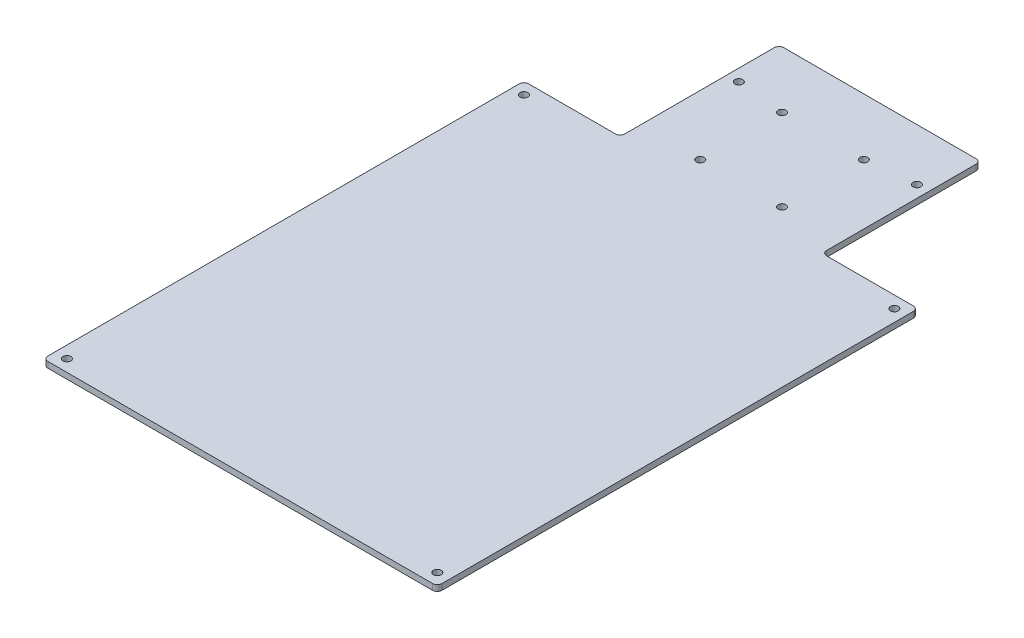
ISO-10303-21;
HEADER;
FILE_DESCRIPTION(('STEP AP214'),'2;1');
FILE_NAME('part.step','',(''),(''),'','','');
FILE_SCHEMA(('AUTOMOTIVE_DESIGN { 1 0 10303 214 1 1 1 1 }'));
ENDSEC;
DATA;
#1=APPLICATION_CONTEXT('core data for automotive mechanical design processes');
#2=APPLICATION_PROTOCOL_DEFINITION('international standard','automotive_design',2000,#1);
#3=PRODUCT_CONTEXT('',#1,'mechanical');
#4=PRODUCT('Part','Part','',(#3));
#5=PRODUCT_RELATED_PRODUCT_CATEGORY('part','',(#4));
#6=PRODUCT_DEFINITION_FORMATION('','',#4);
#7=PRODUCT_DEFINITION_CONTEXT('part definition',#1,'design');
#8=PRODUCT_DEFINITION('design','',#6,#7);
#9=PRODUCT_DEFINITION_SHAPE('','',#8);
#10=(LENGTH_UNIT() NAMED_UNIT(*) SI_UNIT(.MILLI.,.METRE.));
#11=(NAMED_UNIT(*) PLANE_ANGLE_UNIT() SI_UNIT($,.RADIAN.));
#12=(NAMED_UNIT(*) SI_UNIT($,.STERADIAN.) SOLID_ANGLE_UNIT());
#13=UNCERTAINTY_MEASURE_WITH_UNIT(LENGTH_MEASURE(1.E-05),#10,'distance_accuracy_value','');
#14=(GEOMETRIC_REPRESENTATION_CONTEXT(3) GLOBAL_UNCERTAINTY_ASSIGNED_CONTEXT((#13)) GLOBAL_UNIT_ASSIGNED_CONTEXT((#10,
#11,#12)) REPRESENTATION_CONTEXT('',''));
#15=CARTESIAN_POINT('',(0.,0.,0.));
#16=DIRECTION('',(0.,0.,1.));
#17=DIRECTION('',(1.,0.,0.));
#18=AXIS2_PLACEMENT_3D('',#15,#16,#17);
#19=CARTESIAN_POINT('',(0.,3.175,-244.475));
#20=DIRECTION('',(0.,0.,-1.));
#21=DIRECTION('',(-1.,0.,0.));
#22=AXIS2_PLACEMENT_3D('',#19,#20,#21);
#23=PLANE('',#22);
#24=DIRECTION('',(1.,0.,0.));
#25=VECTOR('',#24,1.);
#26=CARTESIAN_POINT('',(0.,0.,-244.475));
#27=LINE('',#26,#25);
#28=CARTESIAN_POINT('',(149.225,0.,-244.475));
#29=VERTEX_POINT('',#28);
#30=CARTESIAN_POINT('',(195.58,0.,-244.475));
#31=VERTEX_POINT('',#30);
#32=EDGE_CURVE('E249',#29,#31,#27,.T.);
#33=ORIENTED_EDGE('',*,*,#32,.F.);
#34=DIRECTION('',(0.,1.,0.));
#35=VECTOR('',#34,1.);
#36=CARTESIAN_POINT('',(149.225,3.175,-244.475));
#37=LINE('',#36,#35);
#38=CARTESIAN_POINT('',(149.225,3.175,-244.475));
#39=VERTEX_POINT('',#38);
#40=EDGE_CURVE('E286',#29,#39,#37,.T.);
#41=ORIENTED_EDGE('',*,*,#40,.T.);
#42=DIRECTION('',(1.,0.,0.));
#43=VECTOR('',#42,1.);
#44=CARTESIAN_POINT('',(0.,3.175,-244.475));
#45=LINE('',#44,#43);
#46=CARTESIAN_POINT('',(195.58,3.175,-244.475));
#47=VERTEX_POINT('',#46);
#48=EDGE_CURVE('E238',#39,#47,#45,.T.);
#49=ORIENTED_EDGE('',*,*,#48,.T.);
#50=DIRECTION('',(0.,-1.,0.));
#51=VECTOR('',#50,1.);
#52=CARTESIAN_POINT('',(195.58,0.,-244.475));
#53=LINE('',#52,#51);
#54=EDGE_CURVE('E283',#47,#31,#53,.T.);
#55=ORIENTED_EDGE('',*,*,#54,.T.);
#56=EDGE_LOOP('',(#33,#41,#49,#55));
#57=FACE_BOUND('',#56,.T.);
#58=ADVANCED_FACE('F49',(#57),#23,.T.);
#59=CARTESIAN_POINT('',(-12.7,3.175,0.));
#60=DIRECTION('',(-1.,0.,0.));
#61=DIRECTION('',(0.,0.,1.));
#62=AXIS2_PLACEMENT_3D('',#59,#60,#61);
#63=PLANE('',#62);
#64=DIRECTION('',(0.,0.,-1.));
#65=VECTOR('',#64,1.);
#66=CARTESIAN_POINT('',(-12.7,0.,0.));
#67=LINE('',#66,#65);
#68=CARTESIAN_POINT('',(-12.7,0.,10.16));
#69=VERTEX_POINT('',#68);
#70=CARTESIAN_POINT('',(-12.7,0.,-241.935));
#71=VERTEX_POINT('',#70);
#72=EDGE_CURVE('E225',#69,#71,#67,.T.);
#73=ORIENTED_EDGE('',*,*,#72,.F.);
#74=DIRECTION('',(0.,-1.,0.));
#75=VECTOR('',#74,1.);
#76=CARTESIAN_POINT('',(-12.7,3.175,10.16));
#77=LINE('',#76,#75);
#78=CARTESIAN_POINT('',(-12.7,3.175,10.16));
#79=VERTEX_POINT('',#78);
#80=EDGE_CURVE('E296',#69,#79,#77,.F.);
#81=ORIENTED_EDGE('',*,*,#80,.T.);
#82=DIRECTION('',(0.,0.,-1.));
#83=VECTOR('',#82,1.);
#84=CARTESIAN_POINT('',(-12.7,3.175,0.));
#85=LINE('',#84,#83);
#86=CARTESIAN_POINT('',(-12.7,3.175,-241.935));
#87=VERTEX_POINT('',#86);
#88=EDGE_CURVE('E228',#79,#87,#85,.T.);
#89=ORIENTED_EDGE('',*,*,#88,.T.);
#90=DIRECTION('',(0.,-1.,0.));
#91=VECTOR('',#90,1.);
#92=CARTESIAN_POINT('',(-12.7,3.175,-241.935));
#93=LINE('',#92,#91);
#94=EDGE_CURVE('E293',#87,#71,#93,.T.);
#95=ORIENTED_EDGE('',*,*,#94,.T.);
#96=EDGE_LOOP('',(#73,#81,#89,#95));
#97=FACE_BOUND('',#96,.T.);
#98=ADVANCED_FACE('F345',(#97),#63,.T.);
#99=CARTESIAN_POINT('',(0.,3.175,12.7));
#100=DIRECTION('',(0.,0.,-1.));
#101=DIRECTION('',(-1.,0.,0.));
#102=AXIS2_PLACEMENT_3D('',#99,#100,#101);
#103=PLANE('',#102);
#104=DIRECTION('',(1.,0.,0.));
#105=VECTOR('',#104,1.);
#106=CARTESIAN_POINT('',(0.,3.175,12.7));
#107=LINE('',#106,#105);
#108=CARTESIAN_POINT('',(-10.16,3.175,12.7));
#109=VERTEX_POINT('',#108);
#110=CARTESIAN_POINT('',(195.58,3.175,12.7));
#111=VERTEX_POINT('',#110);
#112=EDGE_CURVE('E231',#109,#111,#107,.T.);
#113=ORIENTED_EDGE('',*,*,#112,.F.);
#114=DIRECTION('',(0.,-1.,0.));
#115=VECTOR('',#114,1.);
#116=CARTESIAN_POINT('',(-10.16,0.,12.7));
#117=LINE('',#116,#115);
#118=CARTESIAN_POINT('',(-10.16,0.,12.7));
#119=VERTEX_POINT('',#118);
#120=EDGE_CURVE('E291',#109,#119,#117,.T.);
#121=ORIENTED_EDGE('',*,*,#120,.T.);
#122=DIRECTION('',(1.,0.,0.));
#123=VECTOR('',#122,1.);
#124=CARTESIAN_POINT('',(0.,0.,12.7));
#125=LINE('',#124,#123);
#126=CARTESIAN_POINT('',(195.58,0.,12.7));
#127=VERTEX_POINT('',#126);
#128=EDGE_CURVE('E244',#119,#127,#125,.T.);
#129=ORIENTED_EDGE('',*,*,#128,.T.);
#130=DIRECTION('',(0.,-1.,0.));
#131=VECTOR('',#130,1.);
#132=CARTESIAN_POINT('',(195.58,3.175,12.7));
#133=LINE('',#132,#131);
#134=EDGE_CURVE('E289',#127,#111,#133,.F.);
#135=ORIENTED_EDGE('',*,*,#134,.T.);
#136=EDGE_LOOP('',(#113,#121,#129,#135));
#137=FACE_BOUND('',#136,.T.);
#138=ADVANCED_FACE('F339',(#137),#103,.F.);
#139=CARTESIAN_POINT('',(198.12,3.175,0.));
#140=DIRECTION('',(-1.,0.,0.));
#141=DIRECTION('',(0.,0.,1.));
#142=AXIS2_PLACEMENT_3D('',#139,#140,#141);
#143=PLANE('',#142);
#144=DIRECTION('',(0.,0.,-1.));
#145=VECTOR('',#144,1.);
#146=CARTESIAN_POINT('',(198.12,0.,0.));
#147=LINE('',#146,#145);
#148=CARTESIAN_POINT('',(198.12,0.,10.16));
#149=VERTEX_POINT('',#148);
#150=CARTESIAN_POINT('',(198.12,0.,-241.935));
#151=VERTEX_POINT('',#150);
#152=EDGE_CURVE('E246',#149,#151,#147,.T.);
#153=ORIENTED_EDGE('',*,*,#152,.T.);
#154=DIRECTION('',(0.,-1.,0.));
#155=VECTOR('',#154,1.);
#156=CARTESIAN_POINT('',(198.12,3.175,-241.935));
#157=LINE('',#156,#155);
#158=CARTESIAN_POINT('',(198.12,3.175,-241.935));
#159=VERTEX_POINT('',#158);
#160=EDGE_CURVE('E301',#151,#159,#157,.F.);
#161=ORIENTED_EDGE('',*,*,#160,.T.);
#162=DIRECTION('',(0.,0.,-1.));
#163=VECTOR('',#162,1.);
#164=CARTESIAN_POINT('',(198.12,3.175,0.));
#165=LINE('',#164,#163);
#166=CARTESIAN_POINT('',(198.12,3.175,10.16));
#167=VERTEX_POINT('',#166);
#168=EDGE_CURVE('E235',#167,#159,#165,.T.);
#169=ORIENTED_EDGE('',*,*,#168,.F.);
#170=DIRECTION('',(0.,-1.,0.));
#171=VECTOR('',#170,1.);
#172=CARTESIAN_POINT('',(198.12,3.175,10.16));
#173=LINE('',#172,#171);
#174=EDGE_CURVE('E298',#167,#149,#173,.T.);
#175=ORIENTED_EDGE('',*,*,#174,.T.);
#176=EDGE_LOOP('',(#153,#161,#169,#175));
#177=FACE_BOUND('',#176,.T.);
#178=ADVANCED_FACE('F331',(#177),#143,.F.);
#179=CARTESIAN_POINT('',(-10.16,3.175,-244.475));
#180=VERTEX_POINT('',#179);
#181=CARTESIAN_POINT('',(36.195,3.175,-244.475));
#182=VERTEX_POINT('',#181);
#183=EDGE_CURVE('E239',#180,#182,#45,.T.);
#184=ORIENTED_EDGE('',*,*,#183,.T.);
#185=DIRECTION('',(0.,1.,0.));
#186=VECTOR('',#185,1.);
#187=CARTESIAN_POINT('',(36.195,3.175,-244.475));
#188=LINE('',#187,#186);
#189=CARTESIAN_POINT('',(36.195,0.,-244.475));
#190=VERTEX_POINT('',#189);
#191=EDGE_CURVE('E281',#182,#190,#188,.F.);
#192=ORIENTED_EDGE('',*,*,#191,.T.);
#193=CARTESIAN_POINT('',(-10.16,0.,-244.475));
#194=VERTEX_POINT('',#193);
#195=EDGE_CURVE('E232',#194,#190,#27,.T.);
#196=ORIENTED_EDGE('',*,*,#195,.F.);
#197=DIRECTION('',(0.,-1.,0.));
#198=VECTOR('',#197,1.);
#199=CARTESIAN_POINT('',(-10.16,3.175,-244.475));
#200=LINE('',#199,#198);
#201=EDGE_CURVE('E279',#194,#180,#200,.F.);
#202=ORIENTED_EDGE('',*,*,#201,.T.);
#203=EDGE_LOOP('',(#184,#192,#196,#202));
#204=FACE_BOUND('',#203,.T.);
#205=ADVANCED_FACE('F355',(#204),#23,.T.);
#206=CARTESIAN_POINT('',(0.,3.175,0.));
#207=DIRECTION('',(0.,1.,0.));
#208=DIRECTION('',(0.,0.,1.));
#209=AXIS2_PLACEMENT_3D('',#206,#207,#208);
#210=PLANE('',#209);
#211=CARTESIAN_POINT('',(70.8340960890755,3.175,-255.229096089076));
#212=DIRECTION('',(0.,1.,0.));
#213=DIRECTION('',(0.,0.,1.));
#214=AXIS2_PLACEMENT_3D('',#211,#212,#213);
#215=CIRCLE('',#214,2.0955);
#216=CARTESIAN_POINT('',(70.8340960890755,3.175,-253.133596089076));
#217=VERTEX_POINT('',#216);
#218=EDGE_CURVE('E684',#217,#217,#215,.T.);
#219=ORIENTED_EDGE('',*,*,#218,.F.);
#220=EDGE_LOOP('',(#219));
#221=FACE_BOUND('',#220,.T.);
#222=CARTESIAN_POINT('',(114.585903910924,3.175,-255.229096089076));
#223=DIRECTION('',(0.,1.,0.));
#224=DIRECTION('',(0.,0.,1.));
#225=AXIS2_PLACEMENT_3D('',#222,#223,#224);
#226=CIRCLE('',#225,2.0955);
#227=CARTESIAN_POINT('',(114.585903910924,3.175,-253.133596089076));
#228=VERTEX_POINT('',#227);
#229=EDGE_CURVE('E687',#228,#228,#226,.T.);
#230=ORIENTED_EDGE('',*,*,#229,.F.);
#231=EDGE_LOOP('',(#230));
#232=FACE_BOUND('',#231,.T.);
#233=CARTESIAN_POINT('',(114.585903910924,3.175,-298.980903910924));
#234=DIRECTION('',(0.,1.,0.));
#235=DIRECTION('',(0.,0.,1.));
#236=AXIS2_PLACEMENT_3D('',#233,#234,#235);
#237=CIRCLE('',#236,2.0955);
#238=CARTESIAN_POINT('',(114.585903910924,3.175,-296.885403910924));
#239=VERTEX_POINT('',#238);
#240=EDGE_CURVE('E380',#239,#239,#237,.T.);
#241=ORIENTED_EDGE('',*,*,#240,.F.);
#242=EDGE_LOOP('',(#241));
#243=FACE_BOUND('',#242,.T.);
#244=CARTESIAN_POINT('',(70.8340960890755,3.175,-298.980903910924));
#245=DIRECTION('',(0.,1.,0.));
#246=DIRECTION('',(0.,0.,1.));
#247=AXIS2_PLACEMENT_3D('',#244,#245,#246);
#248=CIRCLE('',#247,2.0955);
#249=CARTESIAN_POINT('',(70.8340960890755,3.175,-296.885403910924));
#250=VERTEX_POINT('',#249);
#251=EDGE_CURVE('E375',#250,#250,#248,.T.);
#252=ORIENTED_EDGE('',*,*,#251,.F.);
#253=EDGE_LOOP('',(#252));
#254=FACE_BOUND('',#253,.T.);
#255=CARTESIAN_POINT('',(-6.35,3.175,-238.125));
#256=DIRECTION('',(0.,1.,0.));
#257=DIRECTION('',(0.,0.,1.));
#258=AXIS2_PLACEMENT_3D('',#255,#256,#257);
#259=CIRCLE('',#258,2.09549999999999);
#260=CARTESIAN_POINT('',(-6.35,3.175,-236.0295));
#261=VERTEX_POINT('',#260);
#262=EDGE_CURVE('E218',#261,#261,#259,.T.);
#263=ORIENTED_EDGE('',*,*,#262,.F.);
#264=EDGE_LOOP('',(#263));
#265=FACE_BOUND('',#264,.T.);
#266=CARTESIAN_POINT('',(-6.35,3.175,6.35));
#267=DIRECTION('',(0.,1.,0.));
#268=DIRECTION('',(0.,0.,1.));
#269=AXIS2_PLACEMENT_3D('',#266,#267,#268);
#270=CIRCLE('',#269,2.0955);
#271=CARTESIAN_POINT('',(-6.35,3.175,8.4455));
#272=VERTEX_POINT('',#271);
#273=EDGE_CURVE('E212',#272,#272,#270,.T.);
#274=ORIENTED_EDGE('',*,*,#273,.F.);
#275=EDGE_LOOP('',(#274));
#276=FACE_BOUND('',#275,.T.);
#277=CARTESIAN_POINT('',(191.77,3.175,6.35));
#278=DIRECTION('',(0.,1.,0.));
#279=DIRECTION('',(0.,0.,1.));
#280=AXIS2_PLACEMENT_3D('',#277,#278,#279);
#281=CIRCLE('',#280,2.09549999999999);
#282=CARTESIAN_POINT('',(191.77,3.175,8.44549999999999));
#283=VERTEX_POINT('',#282);
#284=EDGE_CURVE('E206',#283,#283,#281,.T.);
#285=ORIENTED_EDGE('',*,*,#284,.F.);
#286=EDGE_LOOP('',(#285));
#287=FACE_BOUND('',#286,.T.);
#288=CARTESIAN_POINT('',(191.77,3.175,-238.125));
#289=DIRECTION('',(0.,1.,0.));
#290=DIRECTION('',(0.,0.,1.));
#291=AXIS2_PLACEMENT_3D('',#288,#289,#290);
#292=CIRCLE('',#291,2.09549999999998);
#293=CARTESIAN_POINT('',(191.77,3.175,-236.0295));
#294=VERTEX_POINT('',#293);
#295=EDGE_CURVE('E205',#294,#294,#292,.T.);
#296=ORIENTED_EDGE('',*,*,#295,.F.);
#297=EDGE_LOOP('',(#296));
#298=FACE_BOUND('',#297,.T.);
#299=DIRECTION('',(1.,0.,0.));
#300=VECTOR('',#299,1.);
#301=CARTESIAN_POINT('',(-1.69420033557799E-13,3.175,-329.4634));
#302=LINE('',#301,#300);
#303=CARTESIAN_POINT('',(41.275,3.175,-329.4634));
#304=VERTEX_POINT('',#303);
#305=CARTESIAN_POINT('',(144.145,3.175,-329.4634));
#306=VERTEX_POINT('',#305);
#307=EDGE_CURVE('E180',#304,#306,#302,.T.);
#308=ORIENTED_EDGE('',*,*,#307,.F.);
#309=CARTESIAN_POINT('',(41.275,3.175,-326.9234));
#310=DIRECTION('',(0.,1.,0.));
#311=DIRECTION('',(0.,0.,1.));
#312=AXIS2_PLACEMENT_3D('',#309,#310,#311);
#313=CIRCLE('',#312,2.54);
#314=CARTESIAN_POINT('',(38.735,3.175,-326.9234));
#315=VERTEX_POINT('',#314);
#316=EDGE_CURVE('E163',#304,#315,#313,.T.);
#317=ORIENTED_EDGE('',*,*,#316,.T.);
#318=DIRECTION('',(0.,0.,-1.));
#319=VECTOR('',#318,1.);
#320=CARTESIAN_POINT('',(38.735,3.175,0.));
#321=LINE('',#320,#319);
#322=CARTESIAN_POINT('',(38.735,3.175,-247.015));
#323=VERTEX_POINT('',#322);
#324=EDGE_CURVE('E190',#323,#315,#321,.T.);
#325=ORIENTED_EDGE('',*,*,#324,.F.);
#326=CARTESIAN_POINT('',(36.195,3.175,-247.015));
#327=DIRECTION('',(0.,1.,0.));
#328=DIRECTION('',(0.,0.,1.));
#329=AXIS2_PLACEMENT_3D('',#326,#327,#328);
#330=CIRCLE('',#329,2.54);
#331=EDGE_CURVE('E303',#323,#182,#330,.F.);
#332=ORIENTED_EDGE('',*,*,#331,.T.);
#333=ORIENTED_EDGE('',*,*,#183,.F.);
#334=CARTESIAN_POINT('',(-10.16,3.175,-241.935));
#335=DIRECTION('',(0.,1.,0.));
#336=DIRECTION('',(0.,0.,1.));
#337=AXIS2_PLACEMENT_3D('',#334,#335,#336);
#338=CIRCLE('',#337,2.54);
#339=EDGE_CURVE('E256',#180,#87,#338,.T.);
#340=ORIENTED_EDGE('',*,*,#339,.T.);
#341=ORIENTED_EDGE('',*,*,#88,.F.);
#342=CARTESIAN_POINT('',(-10.16,3.175,10.16));
#343=DIRECTION('',(0.,1.,0.));
#344=DIRECTION('',(0.,0.,1.));
#345=AXIS2_PLACEMENT_3D('',#342,#343,#344);
#346=CIRCLE('',#345,2.54);
#347=EDGE_CURVE('E258',#79,#109,#346,.T.);
#348=ORIENTED_EDGE('',*,*,#347,.T.);
#349=ORIENTED_EDGE('',*,*,#112,.T.);
#350=CARTESIAN_POINT('',(195.58,3.175,10.16));
#351=DIRECTION('',(0.,1.,0.));
#352=DIRECTION('',(0.,0.,1.));
#353=AXIS2_PLACEMENT_3D('',#350,#351,#352);
#354=CIRCLE('',#353,2.54);
#355=EDGE_CURVE('E184',#111,#167,#354,.T.);
#356=ORIENTED_EDGE('',*,*,#355,.T.);
#357=ORIENTED_EDGE('',*,*,#168,.T.);
#358=CARTESIAN_POINT('',(195.58,3.175,-241.935));
#359=DIRECTION('',(0.,1.,0.));
#360=DIRECTION('',(0.,0.,1.));
#361=AXIS2_PLACEMENT_3D('',#358,#359,#360);
#362=CIRCLE('',#361,2.54);
#363=EDGE_CURVE('E254',#159,#47,#362,.T.);
#364=ORIENTED_EDGE('',*,*,#363,.T.);
#365=ORIENTED_EDGE('',*,*,#48,.F.);
#366=CARTESIAN_POINT('',(149.225,3.175,-247.015));
#367=DIRECTION('',(0.,1.,0.));
#368=DIRECTION('',(0.,0.,1.));
#369=AXIS2_PLACEMENT_3D('',#366,#367,#368);
#370=CIRCLE('',#369,2.54);
#371=CARTESIAN_POINT('',(146.685,3.175,-247.015));
#372=VERTEX_POINT('',#371);
#373=EDGE_CURVE('E57',#39,#372,#370,.F.);
#374=ORIENTED_EDGE('',*,*,#373,.T.);
#375=DIRECTION('',(0.,0.,-1.));
#376=VECTOR('',#375,1.);
#377=CARTESIAN_POINT('',(146.685000000001,3.175,-3.78932503972241E-13));
#378=LINE('',#377,#376);
#379=CARTESIAN_POINT('',(146.685,3.175,-326.9234));
#380=VERTEX_POINT('',#379);
#381=EDGE_CURVE('E191',#372,#380,#378,.T.);
#382=ORIENTED_EDGE('',*,*,#381,.T.);
#383=CARTESIAN_POINT('',(144.145,3.175,-326.9234));
#384=DIRECTION('',(0.,1.,0.));
#385=DIRECTION('',(0.,0.,1.));
#386=AXIS2_PLACEMENT_3D('',#383,#384,#385);
#387=CIRCLE('',#386,2.54);
#388=EDGE_CURVE('E174',#380,#306,#387,.T.);
#389=ORIENTED_EDGE('',*,*,#388,.T.);
#390=EDGE_LOOP('',(#308,#317,#325,#332,#333,#340,#341,#348,#349,#356,#357,#364,#365,#374,#382,#389));
#391=FACE_BOUND('',#390,.T.);
#392=CARTESIAN_POINT('',(140.335,3.175,-301.625));
#393=DIRECTION('',(0.,1.,0.));
#394=DIRECTION('',(0.,0.,1.));
#395=AXIS2_PLACEMENT_3D('',#392,#393,#394);
#396=CIRCLE('',#395,2.09549999999998);
#397=CARTESIAN_POINT('',(140.335,3.175,-299.5295));
#398=VERTEX_POINT('',#397);
#399=EDGE_CURVE('E195',#398,#398,#396,.T.);
#400=ORIENTED_EDGE('',*,*,#399,.F.);
#401=EDGE_LOOP('',(#400));
#402=FACE_BOUND('',#401,.T.);
#403=CARTESIAN_POINT('',(45.085,3.175,-301.625));
#404=DIRECTION('',(0.,1.,0.));
#405=DIRECTION('',(0.,0.,1.));
#406=AXIS2_PLACEMENT_3D('',#403,#404,#405);
#407=CIRCLE('',#406,2.0955);
#408=CARTESIAN_POINT('',(45.085,3.175,-299.5295));
#409=VERTEX_POINT('',#408);
#410=EDGE_CURVE('E193',#409,#409,#407,.T.);
#411=ORIENTED_EDGE('',*,*,#410,.F.);
#412=EDGE_LOOP('',(#411));
#413=FACE_BOUND('',#412,.T.);
#414=ADVANCED_FACE('F187',(#221,#232,#243,#254,#265,#276,#287,#298,#391,#402,#413),#210,.T.);
#415=CARTESIAN_POINT('',(0.,0.,0.));
#416=DIRECTION('',(0.,1.,0.));
#417=DIRECTION('',(0.,0.,1.));
#418=AXIS2_PLACEMENT_3D('',#415,#416,#417);
#419=PLANE('',#418);
#420=CARTESIAN_POINT('',(70.8340960890755,0.,-255.229096089076));
#421=DIRECTION('',(0.,1.,0.));
#422=DIRECTION('',(0.,0.,1.));
#423=AXIS2_PLACEMENT_3D('',#420,#421,#422);
#424=CIRCLE('',#423,2.0955);
#425=CARTESIAN_POINT('',(70.8340960890755,0.,-253.133596089076));
#426=VERTEX_POINT('',#425);
#427=EDGE_CURVE('E681',#426,#426,#424,.F.);
#428=ORIENTED_EDGE('',*,*,#427,.F.);
#429=EDGE_LOOP('',(#428));
#430=FACE_BOUND('',#429,.T.);
#431=CARTESIAN_POINT('',(114.585903910924,0.,-255.229096089076));
#432=DIRECTION('',(0.,1.,0.));
#433=DIRECTION('',(0.,0.,1.));
#434=AXIS2_PLACEMENT_3D('',#431,#432,#433);
#435=CIRCLE('',#434,2.0955);
#436=CARTESIAN_POINT('',(114.585903910924,0.,-253.133596089076));
#437=VERTEX_POINT('',#436);
#438=EDGE_CURVE('E685',#437,#437,#435,.F.);
#439=ORIENTED_EDGE('',*,*,#438,.F.);
#440=EDGE_LOOP('',(#439));
#441=FACE_BOUND('',#440,.T.);
#442=CARTESIAN_POINT('',(114.585903910924,0.,-298.980903910924));
#443=DIRECTION('',(0.,1.,0.));
#444=DIRECTION('',(0.,0.,1.));
#445=AXIS2_PLACEMENT_3D('',#442,#443,#444);
#446=CIRCLE('',#445,2.0955);
#447=CARTESIAN_POINT('',(114.585903910924,0.,-296.885403910924));
#448=VERTEX_POINT('',#447);
#449=EDGE_CURVE('E692',#448,#448,#446,.F.);
#450=ORIENTED_EDGE('',*,*,#449,.F.);
#451=EDGE_LOOP('',(#450));
#452=FACE_BOUND('',#451,.T.);
#453=CARTESIAN_POINT('',(70.8340960890755,0.,-298.980903910924));
#454=DIRECTION('',(0.,1.,0.));
#455=DIRECTION('',(0.,0.,1.));
#456=AXIS2_PLACEMENT_3D('',#453,#454,#455);
#457=CIRCLE('',#456,2.0955);
#458=CARTESIAN_POINT('',(70.8340960890755,0.,-296.885403910924));
#459=VERTEX_POINT('',#458);
#460=EDGE_CURVE('E371',#459,#459,#457,.F.);
#461=ORIENTED_EDGE('',*,*,#460,.F.);
#462=EDGE_LOOP('',(#461));
#463=FACE_BOUND('',#462,.T.);
#464=CARTESIAN_POINT('',(-6.35,0.,-238.125));
#465=DIRECTION('',(0.,1.,0.));
#466=DIRECTION('',(0.,0.,1.));
#467=AXIS2_PLACEMENT_3D('',#464,#465,#466);
#468=CIRCLE('',#467,2.09549999999999);
#469=CARTESIAN_POINT('',(-6.35,0.,-236.0295));
#470=VERTEX_POINT('',#469);
#471=EDGE_CURVE('E215',#470,#470,#468,.T.);
#472=ORIENTED_EDGE('',*,*,#471,.T.);
#473=EDGE_LOOP('',(#472));
#474=FACE_BOUND('',#473,.T.);
#475=CARTESIAN_POINT('',(-6.35,0.,6.35));
#476=DIRECTION('',(0.,1.,0.));
#477=DIRECTION('',(0.,0.,1.));
#478=AXIS2_PLACEMENT_3D('',#475,#476,#477);
#479=CIRCLE('',#478,2.0955);
#480=CARTESIAN_POINT('',(-6.35,0.,8.4455));
#481=VERTEX_POINT('',#480);
#482=EDGE_CURVE('E209',#481,#481,#479,.T.);
#483=ORIENTED_EDGE('',*,*,#482,.T.);
#484=EDGE_LOOP('',(#483));
#485=FACE_BOUND('',#484,.T.);
#486=CARTESIAN_POINT('',(191.77,0.,6.35));
#487=DIRECTION('',(0.,1.,0.));
#488=DIRECTION('',(0.,0.,1.));
#489=AXIS2_PLACEMENT_3D('',#486,#487,#488);
#490=CIRCLE('',#489,2.09549999999999);
#491=CARTESIAN_POINT('',(191.77,0.,8.44549999999999));
#492=VERTEX_POINT('',#491);
#493=EDGE_CURVE('E202',#492,#492,#490,.T.);
#494=ORIENTED_EDGE('',*,*,#493,.T.);
#495=EDGE_LOOP('',(#494));
#496=FACE_BOUND('',#495,.T.);
#497=CARTESIAN_POINT('',(191.77,0.,-238.125));
#498=DIRECTION('',(0.,1.,0.));
#499=DIRECTION('',(0.,0.,1.));
#500=AXIS2_PLACEMENT_3D('',#497,#498,#499);
#501=CIRCLE('',#500,2.09549999999998);
#502=CARTESIAN_POINT('',(191.77,0.,-236.0295));
#503=VERTEX_POINT('',#502);
#504=EDGE_CURVE('E222',#503,#503,#501,.T.);
#505=ORIENTED_EDGE('',*,*,#504,.T.);
#506=EDGE_LOOP('',(#505));
#507=FACE_BOUND('',#506,.T.);
#508=DIRECTION('',(0.,0.,-1.));
#509=VECTOR('',#508,1.);
#510=CARTESIAN_POINT('',(38.735,0.,0.));
#511=LINE('',#510,#509);
#512=CARTESIAN_POINT('',(38.735,0.,-247.015));
#513=VERTEX_POINT('',#512);
#514=CARTESIAN_POINT('',(38.735,0.,-326.9234));
#515=VERTEX_POINT('',#514);
#516=EDGE_CURVE('E362',#513,#515,#511,.T.);
#517=ORIENTED_EDGE('',*,*,#516,.T.);
#518=CARTESIAN_POINT('',(41.275,0.,-326.9234));
#519=DIRECTION('',(0.,1.,0.));
#520=DIRECTION('',(0.,0.,1.));
#521=AXIS2_PLACEMENT_3D('',#518,#519,#520);
#522=CIRCLE('',#521,2.54);
#523=CARTESIAN_POINT('',(41.275,0.,-329.4634));
#524=VERTEX_POINT('',#523);
#525=EDGE_CURVE('E272',#515,#524,#522,.F.);
#526=ORIENTED_EDGE('',*,*,#525,.T.);
#527=DIRECTION('',(1.,0.,0.));
#528=VECTOR('',#527,1.);
#529=CARTESIAN_POINT('',(-1.69420033557799E-13,0.,-329.4634));
#530=LINE('',#529,#528);
#531=CARTESIAN_POINT('',(144.145,0.,-329.4634));
#532=VERTEX_POINT('',#531);
#533=EDGE_CURVE('E183',#524,#532,#530,.T.);
#534=ORIENTED_EDGE('',*,*,#533,.T.);
#535=CARTESIAN_POINT('',(144.145,0.,-326.9234));
#536=DIRECTION('',(0.,1.,0.));
#537=DIRECTION('',(0.,0.,1.));
#538=AXIS2_PLACEMENT_3D('',#535,#536,#537);
#539=CIRCLE('',#538,2.54);
#540=CARTESIAN_POINT('',(146.685,0.,-326.9234));
#541=VERTEX_POINT('',#540);
#542=EDGE_CURVE('E270',#532,#541,#539,.F.);
#543=ORIENTED_EDGE('',*,*,#542,.T.);
#544=DIRECTION('',(0.,0.,-1.));
#545=VECTOR('',#544,1.);
#546=CARTESIAN_POINT('',(146.685000000001,0.,-3.78932503972241E-13));
#547=LINE('',#546,#545);
#548=CARTESIAN_POINT('',(146.685,0.,-247.015));
#549=VERTEX_POINT('',#548);
#550=EDGE_CURVE('E323',#549,#541,#547,.T.);
#551=ORIENTED_EDGE('',*,*,#550,.F.);
#552=CARTESIAN_POINT('',(149.225,0.,-247.015));
#553=DIRECTION('',(0.,1.,0.));
#554=DIRECTION('',(0.,0.,1.));
#555=AXIS2_PLACEMENT_3D('',#552,#553,#554);
#556=CIRCLE('',#555,2.54);
#557=EDGE_CURVE('E11',#549,#29,#556,.T.);
#558=ORIENTED_EDGE('',*,*,#557,.T.);
#559=ORIENTED_EDGE('',*,*,#32,.T.);
#560=CARTESIAN_POINT('',(195.58,0.,-241.935));
#561=DIRECTION('',(0.,1.,0.));
#562=DIRECTION('',(0.,0.,1.));
#563=AXIS2_PLACEMENT_3D('',#560,#561,#562);
#564=CIRCLE('',#563,2.54);
#565=EDGE_CURVE('E265',#31,#151,#564,.F.);
#566=ORIENTED_EDGE('',*,*,#565,.T.);
#567=ORIENTED_EDGE('',*,*,#152,.F.);
#568=CARTESIAN_POINT('',(195.58,0.,10.16));
#569=DIRECTION('',(0.,1.,0.));
#570=DIRECTION('',(0.,0.,1.));
#571=AXIS2_PLACEMENT_3D('',#568,#569,#570);
#572=CIRCLE('',#571,2.54);
#573=EDGE_CURVE('E64',#149,#127,#572,.F.);
#574=ORIENTED_EDGE('',*,*,#573,.T.);
#575=ORIENTED_EDGE('',*,*,#128,.F.);
#576=CARTESIAN_POINT('',(-10.16,0.,10.16));
#577=DIRECTION('',(0.,1.,0.));
#578=DIRECTION('',(0.,0.,1.));
#579=AXIS2_PLACEMENT_3D('',#576,#577,#578);
#580=CIRCLE('',#579,2.54);
#581=EDGE_CURVE('E72',#119,#69,#580,.F.);
#582=ORIENTED_EDGE('',*,*,#581,.T.);
#583=ORIENTED_EDGE('',*,*,#72,.T.);
#584=CARTESIAN_POINT('',(-10.16,0.,-241.935));
#585=DIRECTION('',(0.,1.,0.));
#586=DIRECTION('',(0.,0.,1.));
#587=AXIS2_PLACEMENT_3D('',#584,#585,#586);
#588=CIRCLE('',#587,2.54);
#589=EDGE_CURVE('E267',#71,#194,#588,.F.);
#590=ORIENTED_EDGE('',*,*,#589,.T.);
#591=ORIENTED_EDGE('',*,*,#195,.T.);
#592=CARTESIAN_POINT('',(36.195,0.,-247.015));
#593=DIRECTION('',(0.,1.,0.));
#594=DIRECTION('',(0.,0.,1.));
#595=AXIS2_PLACEMENT_3D('',#592,#593,#594);
#596=CIRCLE('',#595,2.54);
#597=EDGE_CURVE('E305',#190,#513,#596,.T.);
#598=ORIENTED_EDGE('',*,*,#597,.T.);
#599=EDGE_LOOP('',(#517,#526,#534,#543,#551,#558,#559,#566,#567,#574,#575,#582,#583,#590,#591,#598));
#600=FACE_BOUND('',#599,.T.);
#601=CARTESIAN_POINT('',(140.335,0.,-301.625));
#602=DIRECTION('',(0.,1.,0.));
#603=DIRECTION('',(0.,0.,1.));
#604=AXIS2_PLACEMENT_3D('',#601,#602,#603);
#605=CIRCLE('',#604,2.09549999999998);
#606=CARTESIAN_POINT('',(140.335,0.,-299.5295));
#607=VERTEX_POINT('',#606);
#608=EDGE_CURVE('E201',#607,#607,#605,.T.);
#609=ORIENTED_EDGE('',*,*,#608,.T.);
#610=EDGE_LOOP('',(#609));
#611=FACE_BOUND('',#610,.T.);
#612=CARTESIAN_POINT('',(45.085,0.,-301.625));
#613=DIRECTION('',(0.,1.,0.));
#614=DIRECTION('',(0.,0.,1.));
#615=AXIS2_PLACEMENT_3D('',#612,#613,#614);
#616=CIRCLE('',#615,2.0955);
#617=CARTESIAN_POINT('',(45.085,0.,-299.5295));
#618=VERTEX_POINT('',#617);
#619=EDGE_CURVE('E221',#618,#618,#616,.T.);
#620=ORIENTED_EDGE('',*,*,#619,.T.);
#621=EDGE_LOOP('',(#620));
#622=FACE_BOUND('',#621,.T.);
#623=ADVANCED_FACE('F321',(#430,#441,#452,#463,#474,#485,#496,#507,#600,#611,#622),#419,.F.);
#624=CARTESIAN_POINT('',(191.77,0.,-238.125));
#625=DIRECTION('',(0.,1.,0.));
#626=DIRECTION('',(0.,0.,1.));
#627=AXIS2_PLACEMENT_3D('',#624,#625,#626);
#628=CYLINDRICAL_SURFACE('',#627,2.09549999999998);
#629=ORIENTED_EDGE('',*,*,#504,.F.);
#630=EDGE_LOOP('',(#629));
#631=FACE_BOUND('',#630,.T.);
#632=ORIENTED_EDGE('',*,*,#295,.T.);
#633=EDGE_LOOP('',(#632));
#634=FACE_BOUND('',#633,.T.);
#635=ADVANCED_FACE('F449',(#631,#634),#628,.F.);
#636=CARTESIAN_POINT('',(191.77,0.,6.35));
#637=DIRECTION('',(0.,1.,0.));
#638=DIRECTION('',(0.,0.,1.));
#639=AXIS2_PLACEMENT_3D('',#636,#637,#638);
#640=CYLINDRICAL_SURFACE('',#639,2.09549999999999);
#641=ORIENTED_EDGE('',*,*,#493,.F.);
#642=EDGE_LOOP('',(#641));
#643=FACE_BOUND('',#642,.T.);
#644=ORIENTED_EDGE('',*,*,#284,.T.);
#645=EDGE_LOOP('',(#644));
#646=FACE_BOUND('',#645,.T.);
#647=ADVANCED_FACE('F458',(#643,#646),#640,.F.);
#648=CARTESIAN_POINT('',(-6.35,0.,6.35));
#649=DIRECTION('',(0.,1.,0.));
#650=DIRECTION('',(0.,0.,1.));
#651=AXIS2_PLACEMENT_3D('',#648,#649,#650);
#652=CYLINDRICAL_SURFACE('',#651,2.0955);
#653=ORIENTED_EDGE('',*,*,#482,.F.);
#654=EDGE_LOOP('',(#653));
#655=FACE_BOUND('',#654,.T.);
#656=ORIENTED_EDGE('',*,*,#273,.T.);
#657=EDGE_LOOP('',(#656));
#658=FACE_BOUND('',#657,.T.);
#659=ADVANCED_FACE('F467',(#655,#658),#652,.F.);
#660=CARTESIAN_POINT('',(-6.35,0.,-238.125));
#661=DIRECTION('',(0.,1.,0.));
#662=DIRECTION('',(0.,0.,1.));
#663=AXIS2_PLACEMENT_3D('',#660,#661,#662);
#664=CYLINDRICAL_SURFACE('',#663,2.09549999999999);
#665=ORIENTED_EDGE('',*,*,#471,.F.);
#666=EDGE_LOOP('',(#665));
#667=FACE_BOUND('',#666,.T.);
#668=ORIENTED_EDGE('',*,*,#262,.T.);
#669=EDGE_LOOP('',(#668));
#670=FACE_BOUND('',#669,.T.);
#671=ADVANCED_FACE('F476',(#667,#670),#664,.F.);
#672=CARTESIAN_POINT('',(38.735,0.,0.));
#673=DIRECTION('',(1.,0.,0.));
#674=DIRECTION('',(0.,0.,-1.));
#675=AXIS2_PLACEMENT_3D('',#672,#673,#674);
#676=PLANE('',#675);
#677=ORIENTED_EDGE('',*,*,#324,.T.);
#678=DIRECTION('',(0.,1.,0.));
#679=VECTOR('',#678,1.);
#680=CARTESIAN_POINT('',(38.735,0.,-326.9234));
#681=LINE('',#680,#679);
#682=EDGE_CURVE('E168',#315,#515,#681,.F.);
#683=ORIENTED_EDGE('',*,*,#682,.T.);
#684=ORIENTED_EDGE('',*,*,#516,.F.);
#685=DIRECTION('',(0.,1.,0.));
#686=VECTOR('',#685,1.);
#687=CARTESIAN_POINT('',(38.735,0.,-247.015));
#688=LINE('',#687,#686);
#689=EDGE_CURVE('E173',#513,#323,#688,.T.);
#690=ORIENTED_EDGE('',*,*,#689,.T.);
#691=EDGE_LOOP('',(#677,#683,#684,#690));
#692=FACE_BOUND('',#691,.T.);
#693=ADVANCED_FACE('F364',(#692),#676,.F.);
#694=CARTESIAN_POINT('',(-1.69420033557799E-13,0.,-329.4634));
#695=DIRECTION('',(0.,0.,1.));
#696=DIRECTION('',(1.,0.,0.));
#697=AXIS2_PLACEMENT_3D('',#694,#695,#696);
#698=PLANE('',#697);
#699=ORIENTED_EDGE('',*,*,#533,.F.);
#700=DIRECTION('',(0.,1.,0.));
#701=VECTOR('',#700,1.);
#702=CARTESIAN_POINT('',(41.275,0.,-329.4634));
#703=LINE('',#702,#701);
#704=EDGE_CURVE('E167',#524,#304,#703,.T.);
#705=ORIENTED_EDGE('',*,*,#704,.T.);
#706=ORIENTED_EDGE('',*,*,#307,.T.);
#707=DIRECTION('',(0.,1.,0.));
#708=VECTOR('',#707,1.);
#709=CARTESIAN_POINT('',(144.145,0.,-329.4634));
#710=LINE('',#709,#708);
#711=EDGE_CURVE('E185',#306,#532,#710,.F.);
#712=ORIENTED_EDGE('',*,*,#711,.T.);
#713=EDGE_LOOP('',(#699,#705,#706,#712));
#714=FACE_BOUND('',#713,.T.);
#715=ADVANCED_FACE('F179',(#714),#698,.F.);
#716=CARTESIAN_POINT('',(146.685000000001,0.,-3.78932503972241E-13));
#717=DIRECTION('',(1.,0.,0.));
#718=DIRECTION('',(0.,0.,-1.));
#719=AXIS2_PLACEMENT_3D('',#716,#717,#718);
#720=PLANE('',#719);
#721=ORIENTED_EDGE('',*,*,#550,.T.);
#722=DIRECTION('',(0.,1.,0.));
#723=VECTOR('',#722,1.);
#724=CARTESIAN_POINT('',(146.685,3.175,-326.9234));
#725=LINE('',#724,#723);
#726=EDGE_CURVE('E276',#541,#380,#725,.T.);
#727=ORIENTED_EDGE('',*,*,#726,.T.);
#728=ORIENTED_EDGE('',*,*,#381,.F.);
#729=DIRECTION('',(0.,1.,0.));
#730=VECTOR('',#729,1.);
#731=CARTESIAN_POINT('',(146.685,0.,-247.015));
#732=LINE('',#731,#730);
#733=EDGE_CURVE('E274',#372,#549,#732,.F.);
#734=ORIENTED_EDGE('',*,*,#733,.T.);
#735=EDGE_LOOP('',(#721,#727,#728,#734));
#736=FACE_BOUND('',#735,.T.);
#737=ADVANCED_FACE('F314',(#736),#720,.T.);
#738=CARTESIAN_POINT('',(140.335,0.,-301.625));
#739=DIRECTION('',(0.,1.,0.));
#740=DIRECTION('',(0.,0.,1.));
#741=AXIS2_PLACEMENT_3D('',#738,#739,#740);
#742=CYLINDRICAL_SURFACE('',#741,2.09549999999998);
#743=ORIENTED_EDGE('',*,*,#608,.F.);
#744=EDGE_LOOP('',(#743));
#745=FACE_BOUND('',#744,.T.);
#746=ORIENTED_EDGE('',*,*,#399,.T.);
#747=EDGE_LOOP('',(#746));
#748=FACE_BOUND('',#747,.T.);
#749=ADVANCED_FACE('F513',(#745,#748),#742,.F.);
#750=CARTESIAN_POINT('',(45.085,0.,-301.625));
#751=DIRECTION('',(0.,1.,0.));
#752=DIRECTION('',(0.,0.,1.));
#753=AXIS2_PLACEMENT_3D('',#750,#751,#752);
#754=CYLINDRICAL_SURFACE('',#753,2.0955);
#755=ORIENTED_EDGE('',*,*,#619,.F.);
#756=EDGE_LOOP('',(#755));
#757=FACE_BOUND('',#756,.T.);
#758=ORIENTED_EDGE('',*,*,#410,.T.);
#759=EDGE_LOOP('',(#758));
#760=FACE_BOUND('',#759,.T.);
#761=ADVANCED_FACE('F395',(#757,#760),#754,.F.);
#762=CARTESIAN_POINT('',(41.275,0.,-326.9234));
#763=DIRECTION('',(0.,1.,0.));
#764=DIRECTION('',(0.,0.,1.));
#765=AXIS2_PLACEMENT_3D('',#762,#763,#764);
#766=CYLINDRICAL_SURFACE('',#765,2.54);
#767=ORIENTED_EDGE('',*,*,#525,.F.);
#768=ORIENTED_EDGE('',*,*,#682,.F.);
#769=ORIENTED_EDGE('',*,*,#316,.F.);
#770=ORIENTED_EDGE('',*,*,#704,.F.);
#771=EDGE_LOOP('',(#767,#768,#769,#770));
#772=FACE_BOUND('',#771,.T.);
#773=ADVANCED_FACE('F166',(#772),#766,.T.);
#774=CARTESIAN_POINT('',(144.145,0.,-326.9234));
#775=DIRECTION('',(0.,-1.,0.));
#776=DIRECTION('',(0.,0.,-1.));
#777=AXIS2_PLACEMENT_3D('',#774,#775,#776);
#778=CYLINDRICAL_SURFACE('',#777,2.54);
#779=ORIENTED_EDGE('',*,*,#542,.F.);
#780=ORIENTED_EDGE('',*,*,#711,.F.);
#781=ORIENTED_EDGE('',*,*,#388,.F.);
#782=ORIENTED_EDGE('',*,*,#726,.F.);
#783=EDGE_LOOP('',(#779,#780,#781,#782));
#784=FACE_BOUND('',#783,.T.);
#785=ADVANCED_FACE('F387',(#784),#778,.T.);
#786=CARTESIAN_POINT('',(36.195,0.,-247.015));
#787=DIRECTION('',(0.,1.,0.));
#788=DIRECTION('',(0.,0.,1.));
#789=AXIS2_PLACEMENT_3D('',#786,#787,#788);
#790=CYLINDRICAL_SURFACE('',#789,2.54);
#791=ORIENTED_EDGE('',*,*,#597,.F.);
#792=ORIENTED_EDGE('',*,*,#191,.F.);
#793=ORIENTED_EDGE('',*,*,#331,.F.);
#794=ORIENTED_EDGE('',*,*,#689,.F.);
#795=EDGE_LOOP('',(#791,#792,#793,#794));
#796=FACE_BOUND('',#795,.T.);
#797=ADVANCED_FACE('F359',(#796),#790,.F.);
#798=CARTESIAN_POINT('',(149.225,3.175,-247.015));
#799=DIRECTION('',(0.,-1.,0.));
#800=DIRECTION('',(0.,0.,-1.));
#801=AXIS2_PLACEMENT_3D('',#798,#799,#800);
#802=CYLINDRICAL_SURFACE('',#801,2.54);
#803=ORIENTED_EDGE('',*,*,#557,.F.);
#804=ORIENTED_EDGE('',*,*,#733,.F.);
#805=ORIENTED_EDGE('',*,*,#373,.F.);
#806=ORIENTED_EDGE('',*,*,#40,.F.);
#807=EDGE_LOOP('',(#803,#804,#805,#806));
#808=FACE_BOUND('',#807,.T.);
#809=ADVANCED_FACE('F318',(#808),#802,.F.);
#810=CARTESIAN_POINT('',(-10.16,3.175,10.16));
#811=DIRECTION('',(0.,1.,0.));
#812=DIRECTION('',(0.,0.,1.));
#813=AXIS2_PLACEMENT_3D('',#810,#811,#812);
#814=CYLINDRICAL_SURFACE('',#813,2.54);
#815=ORIENTED_EDGE('',*,*,#347,.F.);
#816=ORIENTED_EDGE('',*,*,#80,.F.);
#817=ORIENTED_EDGE('',*,*,#581,.F.);
#818=ORIENTED_EDGE('',*,*,#120,.F.);
#819=EDGE_LOOP('',(#815,#816,#817,#818));
#820=FACE_BOUND('',#819,.T.);
#821=ADVANCED_FACE('F342',(#820),#814,.T.);
#822=CARTESIAN_POINT('',(-10.16,3.175,-241.935));
#823=DIRECTION('',(0.,-1.,0.));
#824=DIRECTION('',(0.,0.,-1.));
#825=AXIS2_PLACEMENT_3D('',#822,#823,#824);
#826=CYLINDRICAL_SURFACE('',#825,2.54);
#827=ORIENTED_EDGE('',*,*,#339,.F.);
#828=ORIENTED_EDGE('',*,*,#201,.F.);
#829=ORIENTED_EDGE('',*,*,#589,.F.);
#830=ORIENTED_EDGE('',*,*,#94,.F.);
#831=EDGE_LOOP('',(#827,#828,#829,#830));
#832=FACE_BOUND('',#831,.T.);
#833=ADVANCED_FACE('F349',(#832),#826,.T.);
#834=CARTESIAN_POINT('',(195.58,3.175,-241.935));
#835=DIRECTION('',(0.,1.,0.));
#836=DIRECTION('',(0.,0.,1.));
#837=AXIS2_PLACEMENT_3D('',#834,#835,#836);
#838=CYLINDRICAL_SURFACE('',#837,2.54);
#839=ORIENTED_EDGE('',*,*,#363,.F.);
#840=ORIENTED_EDGE('',*,*,#160,.F.);
#841=ORIENTED_EDGE('',*,*,#565,.F.);
#842=ORIENTED_EDGE('',*,*,#54,.F.);
#843=EDGE_LOOP('',(#839,#840,#841,#842));
#844=FACE_BOUND('',#843,.T.);
#845=ADVANCED_FACE('F328',(#844),#838,.T.);
#846=CARTESIAN_POINT('',(195.58,3.175,10.16));
#847=DIRECTION('',(0.,-1.,0.));
#848=DIRECTION('',(0.,0.,-1.));
#849=AXIS2_PLACEMENT_3D('',#846,#847,#848);
#850=CYLINDRICAL_SURFACE('',#849,2.54);
#851=ORIENTED_EDGE('',*,*,#355,.F.);
#852=ORIENTED_EDGE('',*,*,#134,.F.);
#853=ORIENTED_EDGE('',*,*,#573,.F.);
#854=ORIENTED_EDGE('',*,*,#174,.F.);
#855=EDGE_LOOP('',(#851,#852,#853,#854));
#856=FACE_BOUND('',#855,.T.);
#857=ADVANCED_FACE('F51',(#856),#850,.T.);
#858=CARTESIAN_POINT('',(70.8340960890755,-5.9269690399056,-298.980903910924));
#859=DIRECTION('',(0.,1.,0.));
#860=DIRECTION('',(0.,0.,1.));
#861=AXIS2_PLACEMENT_3D('',#858,#859,#860);
#862=CYLINDRICAL_SURFACE('',#861,2.0955);
#863=ORIENTED_EDGE('',*,*,#460,.T.);
#864=EDGE_LOOP('',(#863));
#865=FACE_BOUND('',#864,.T.);
#866=ORIENTED_EDGE('',*,*,#251,.T.);
#867=EDGE_LOOP('',(#866));
#868=FACE_BOUND('',#867,.T.);
#869=ADVANCED_FACE('F579',(#865,#868),#862,.F.);
#870=CARTESIAN_POINT('',(114.585903910924,-5.9269690399056,-298.980903910924));
#871=DIRECTION('',(0.,1.,0.));
#872=DIRECTION('',(0.,0.,1.));
#873=AXIS2_PLACEMENT_3D('',#870,#871,#872);
#874=CYLINDRICAL_SURFACE('',#873,2.0955);
#875=ORIENTED_EDGE('',*,*,#449,.T.);
#876=EDGE_LOOP('',(#875));
#877=FACE_BOUND('',#876,.T.);
#878=ORIENTED_EDGE('',*,*,#240,.T.);
#879=EDGE_LOOP('',(#878));
#880=FACE_BOUND('',#879,.T.);
#881=ADVANCED_FACE('F586',(#877,#880),#874,.F.);
#882=CARTESIAN_POINT('',(114.585903910924,-5.9269690399056,-255.229096089076));
#883=DIRECTION('',(0.,1.,0.));
#884=DIRECTION('',(0.,0.,1.));
#885=AXIS2_PLACEMENT_3D('',#882,#883,#884);
#886=CYLINDRICAL_SURFACE('',#885,2.0955);
#887=ORIENTED_EDGE('',*,*,#438,.T.);
#888=EDGE_LOOP('',(#887));
#889=FACE_BOUND('',#888,.T.);
#890=ORIENTED_EDGE('',*,*,#229,.T.);
#891=EDGE_LOOP('',(#890));
#892=FACE_BOUND('',#891,.T.);
#893=ADVANCED_FACE('F594',(#889,#892),#886,.F.);
#894=CARTESIAN_POINT('',(70.8340960890755,-5.9269690399056,-255.229096089076));
#895=DIRECTION('',(0.,1.,0.));
#896=DIRECTION('',(0.,0.,1.));
#897=AXIS2_PLACEMENT_3D('',#894,#895,#896);
#898=CYLINDRICAL_SURFACE('',#897,2.0955);
#899=ORIENTED_EDGE('',*,*,#427,.T.);
#900=EDGE_LOOP('',(#899));
#901=FACE_BOUND('',#900,.T.);
#902=ORIENTED_EDGE('',*,*,#218,.T.);
#903=EDGE_LOOP('',(#902));
#904=FACE_BOUND('',#903,.T.);
#905=ADVANCED_FACE('F603',(#901,#904),#898,.F.);
#906=CLOSED_SHELL('',(#58,#98,#138,#178,#205,#414,#623,#635,#647,#659,#671,#693,#715,#737,#749,
#761,#773,#785,#797,#809,#821,#833,#845,#857,#869,#881,#893,#905));
#907=MANIFOLD_SOLID_BREP('B2',#906);
#908=ADVANCED_BREP_SHAPE_REPRESENTATION('',(#18,#907),#14);
#909=SHAPE_DEFINITION_REPRESENTATION(#9,#908);
ENDSEC;
END-ISO-10303-21;
